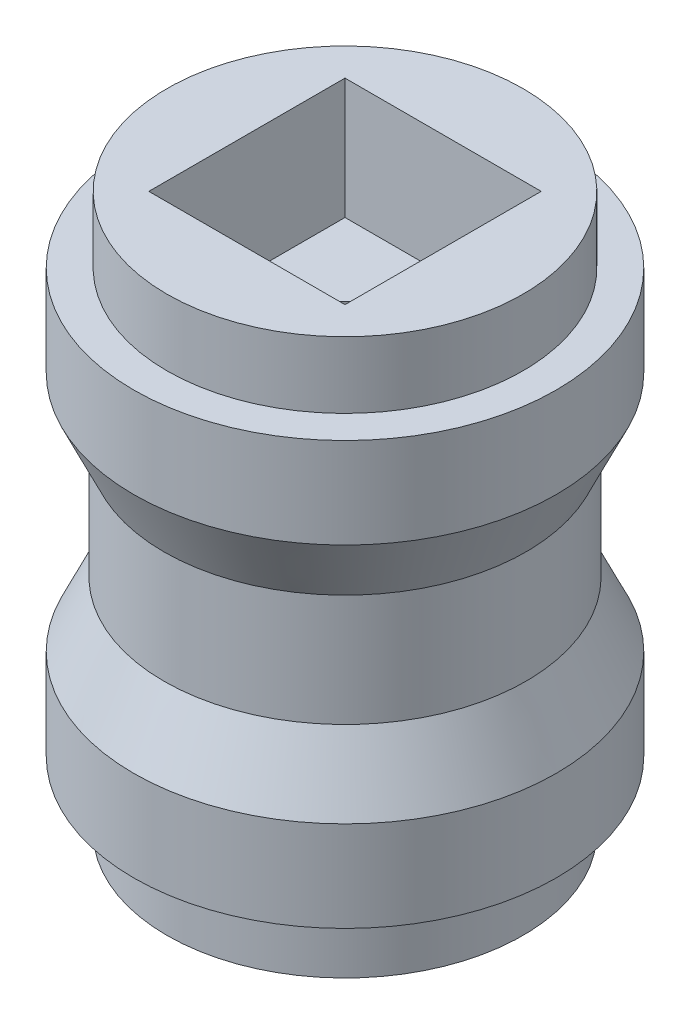
ISO-10303-21;
HEADER;
FILE_DESCRIPTION(('STEP AP214'),'2;1');
FILE_NAME('part.step','',(''),(''),'','','');
FILE_SCHEMA(('AUTOMOTIVE_DESIGN { 1 0 10303 214 1 1 1 1 }'));
ENDSEC;
DATA;
#1=APPLICATION_CONTEXT('core data for automotive mechanical design processes');
#2=APPLICATION_PROTOCOL_DEFINITION('international standard','automotive_design',2000,#1);
#3=PRODUCT_CONTEXT('',#1,'mechanical');
#4=PRODUCT('Part','Part','',(#3));
#5=PRODUCT_RELATED_PRODUCT_CATEGORY('part','',(#4));
#6=PRODUCT_DEFINITION_FORMATION('','',#4);
#7=PRODUCT_DEFINITION_CONTEXT('part definition',#1,'design');
#8=PRODUCT_DEFINITION('design','',#6,#7);
#9=PRODUCT_DEFINITION_SHAPE('','',#8);
#10=(LENGTH_UNIT() NAMED_UNIT(*) SI_UNIT(.MILLI.,.METRE.));
#11=(NAMED_UNIT(*) PLANE_ANGLE_UNIT() SI_UNIT($,.RADIAN.));
#12=(NAMED_UNIT(*) SI_UNIT($,.STERADIAN.) SOLID_ANGLE_UNIT());
#13=UNCERTAINTY_MEASURE_WITH_UNIT(LENGTH_MEASURE(1.E-05),#10,'distance_accuracy_value','');
#14=(GEOMETRIC_REPRESENTATION_CONTEXT(3) GLOBAL_UNCERTAINTY_ASSIGNED_CONTEXT((#13)) GLOBAL_UNIT_ASSIGNED_CONTEXT((#10,
#11,#12)) REPRESENTATION_CONTEXT('',''));
#15=CARTESIAN_POINT('',(0.,0.,0.));
#16=DIRECTION('',(0.,0.,1.));
#17=DIRECTION('',(1.,0.,0.));
#18=AXIS2_PLACEMENT_3D('',#15,#16,#17);
#19=CARTESIAN_POINT('',(0.,3.,0.));
#20=DIRECTION('',(0.,-1.,0.));
#21=DIRECTION('',(0.,0.,-1.));
#22=AXIS2_PLACEMENT_3D('',#19,#20,#21);
#23=CYLINDRICAL_SURFACE('',#22,7.);
#24=CARTESIAN_POINT('',(0.,3.,0.));
#25=DIRECTION('',(0.,1.,0.));
#26=DIRECTION('',(0.,0.,1.));
#27=AXIS2_PLACEMENT_3D('',#24,#25,#26);
#28=CIRCLE('',#27,7.);
#29=CARTESIAN_POINT('',(0.,3.,7.));
#30=VERTEX_POINT('',#29);
#31=EDGE_CURVE('E198',#30,#30,#28,.T.);
#32=ORIENTED_EDGE('',*,*,#31,.F.);
#33=EDGE_LOOP('',(#32));
#34=FACE_BOUND('',#33,.T.);
#35=CARTESIAN_POINT('',(0.,0.,0.));
#36=DIRECTION('',(0.,1.,0.));
#37=DIRECTION('',(0.,0.,1.));
#38=AXIS2_PLACEMENT_3D('',#35,#36,#37);
#39=CIRCLE('',#38,7.);
#40=CARTESIAN_POINT('',(0.,0.,7.));
#41=VERTEX_POINT('',#40);
#42=EDGE_CURVE('E195',#41,#41,#39,.T.);
#43=ORIENTED_EDGE('',*,*,#42,.T.);
#44=EDGE_LOOP('',(#43));
#45=FACE_BOUND('',#44,.T.);
#46=ADVANCED_FACE('F36',(#34,#45),#23,.T.);
#47=CARTESIAN_POINT('',(0.,0.,0.));
#48=DIRECTION('',(0.,1.,0.));
#49=DIRECTION('',(0.,0.,1.));
#50=AXIS2_PLACEMENT_3D('',#47,#48,#49);
#51=PLANE('',#50);
#52=CARTESIAN_POINT('',(0.,0.,0.));
#53=DIRECTION('',(0.,-1.,0.));
#54=DIRECTION('',(0.,0.,-1.));
#55=AXIS2_PLACEMENT_3D('',#52,#53,#54);
#56=CIRCLE('',#55,5.9);
#57=CARTESIAN_POINT('',(0.,0.,-5.9));
#58=VERTEX_POINT('',#57);
#59=EDGE_CURVE('E11',#58,#58,#56,.T.);
#60=ORIENTED_EDGE('',*,*,#59,.F.);
#61=EDGE_LOOP('',(#60));
#62=FACE_BOUND('',#61,.T.);
#63=ORIENTED_EDGE('',*,*,#42,.F.);
#64=EDGE_LOOP('',(#63));
#65=FACE_BOUND('',#64,.T.);
#66=ADVANCED_FACE('F230',(#62,#65),#51,.F.);
#67=CARTESIAN_POINT('',(0.,11.,0.));
#68=DIRECTION('',(0.,-1.,0.));
#69=DIRECTION('',(0.,0.,-1.));
#70=AXIS2_PLACEMENT_3D('',#67,#68,#69);
#71=CYLINDRICAL_SURFACE('',#70,6.);
#72=CARTESIAN_POINT('',(0.,8.85549307949042,0.));
#73=DIRECTION('',(0.,1.,0.));
#74=DIRECTION('',(0.,0.,1.));
#75=AXIS2_PLACEMENT_3D('',#72,#73,#74);
#76=CIRCLE('',#75,6.);
#77=CARTESIAN_POINT('',(0.,8.85549307949042,6.));
#78=VERTEX_POINT('',#77);
#79=EDGE_CURVE('E190',#78,#78,#76,.F.);
#80=ORIENTED_EDGE('',*,*,#79,.T.);
#81=EDGE_LOOP('',(#80));
#82=FACE_BOUND('',#81,.T.);
#83=CARTESIAN_POINT('',(0.,5.1445069205096,0.));
#84=DIRECTION('',(0.,1.,0.));
#85=DIRECTION('',(0.,0.,1.));
#86=AXIS2_PLACEMENT_3D('',#83,#84,#85);
#87=CIRCLE('',#86,6.);
#88=CARTESIAN_POINT('',(0.,5.1445069205096,6.));
#89=VERTEX_POINT('',#88);
#90=EDGE_CURVE('E201',#89,#89,#87,.T.);
#91=ORIENTED_EDGE('',*,*,#90,.T.);
#92=EDGE_LOOP('',(#91));
#93=FACE_BOUND('',#92,.T.);
#94=ADVANCED_FACE('F210',(#82,#93),#71,.T.);
#95=CARTESIAN_POINT('',(0.,14.,0.));
#96=DIRECTION('',(0.,-1.,0.));
#97=DIRECTION('',(0.,0.,-1.));
#98=AXIS2_PLACEMENT_3D('',#95,#96,#97);
#99=CYLINDRICAL_SURFACE('',#98,7.);
#100=CARTESIAN_POINT('',(0.,14.,0.));
#101=DIRECTION('',(0.,1.,0.));
#102=DIRECTION('',(0.,0.,1.));
#103=AXIS2_PLACEMENT_3D('',#100,#101,#102);
#104=CIRCLE('',#103,7.);
#105=CARTESIAN_POINT('',(0.,14.,7.));
#106=VERTEX_POINT('',#105);
#107=EDGE_CURVE('E191',#106,#106,#104,.T.);
#108=ORIENTED_EDGE('',*,*,#107,.F.);
#109=EDGE_LOOP('',(#108));
#110=FACE_BOUND('',#109,.T.);
#111=CARTESIAN_POINT('',(0.,11.,0.));
#112=DIRECTION('',(0.,1.,0.));
#113=DIRECTION('',(0.,0.,1.));
#114=AXIS2_PLACEMENT_3D('',#111,#112,#113);
#115=CIRCLE('',#114,7.);
#116=CARTESIAN_POINT('',(0.,11.,7.));
#117=VERTEX_POINT('',#116);
#118=EDGE_CURVE('E187',#117,#117,#115,.T.);
#119=ORIENTED_EDGE('',*,*,#118,.T.);
#120=EDGE_LOOP('',(#119));
#121=FACE_BOUND('',#120,.T.);
#122=ADVANCED_FACE('F219',(#110,#121),#99,.T.);
#123=CARTESIAN_POINT('',(0.,14.,0.));
#124=DIRECTION('',(0.,1.,0.));
#125=DIRECTION('',(0.,0.,1.));
#126=AXIS2_PLACEMENT_3D('',#123,#124,#125);
#127=PLANE('',#126);
#128=CARTESIAN_POINT('',(0.,14.,0.));
#129=DIRECTION('',(0.,1.,0.));
#130=DIRECTION('',(0.,0.,1.));
#131=AXIS2_PLACEMENT_3D('',#128,#129,#130);
#132=CIRCLE('',#131,5.9);
#133=CARTESIAN_POINT('',(0.,14.,5.9));
#134=VERTEX_POINT('',#133);
#135=EDGE_CURVE('E46',#134,#134,#132,.T.);
#136=ORIENTED_EDGE('',*,*,#135,.F.);
#137=EDGE_LOOP('',(#136));
#138=FACE_BOUND('',#137,.T.);
#139=ORIENTED_EDGE('',*,*,#107,.T.);
#140=EDGE_LOOP('',(#139));
#141=FACE_BOUND('',#140,.T.);
#142=ADVANCED_FACE('F221',(#138,#141),#127,.T.);
#143=CARTESIAN_POINT('',(0.,5.1445069205096,0.));
#144=DIRECTION('',(0.,-1.,0.));
#145=DIRECTION('',(0.,0.,-1.));
#146=AXIS2_PLACEMENT_3D('',#143,#144,#145);
#147=CONICAL_SURFACE('',#146,6.,0.436332312998576);
#148=ORIENTED_EDGE('',*,*,#31,.T.);
#149=EDGE_LOOP('',(#148));
#150=FACE_BOUND('',#149,.T.);
#151=ORIENTED_EDGE('',*,*,#90,.F.);
#152=EDGE_LOOP('',(#151));
#153=FACE_BOUND('',#152,.T.);
#154=ADVANCED_FACE('F216',(#150,#153),#147,.T.);
#155=CARTESIAN_POINT('',(0.,11.,0.));
#156=DIRECTION('',(0.,1.,0.));
#157=DIRECTION('',(0.,0.,1.));
#158=AXIS2_PLACEMENT_3D('',#155,#156,#157);
#159=CONICAL_SURFACE('',#158,6.99999999999999,0.436332312998576);
#160=ORIENTED_EDGE('',*,*,#79,.F.);
#161=EDGE_LOOP('',(#160));
#162=FACE_BOUND('',#161,.T.);
#163=ORIENTED_EDGE('',*,*,#118,.F.);
#164=EDGE_LOOP('',(#163));
#165=FACE_BOUND('',#164,.T.);
#166=ADVANCED_FACE('F38',(#162,#165),#159,.T.);
#167=CARTESIAN_POINT('',(0.,16.2,0.));
#168=DIRECTION('',(0.,-1.,0.));
#169=DIRECTION('',(0.,0.,-1.));
#170=AXIS2_PLACEMENT_3D('',#167,#168,#169);
#171=CYLINDRICAL_SURFACE('',#170,5.9);
#172=CARTESIAN_POINT('',(0.,16.2,0.));
#173=DIRECTION('',(0.,1.,0.));
#174=DIRECTION('',(0.,0.,1.));
#175=AXIS2_PLACEMENT_3D('',#172,#173,#174);
#176=CIRCLE('',#175,5.9);
#177=CARTESIAN_POINT('',(0.,16.2,5.9));
#178=VERTEX_POINT('',#177);
#179=EDGE_CURVE('E183',#178,#178,#176,.T.);
#180=ORIENTED_EDGE('',*,*,#179,.F.);
#181=EDGE_LOOP('',(#180));
#182=FACE_BOUND('',#181,.T.);
#183=ORIENTED_EDGE('',*,*,#135,.T.);
#184=EDGE_LOOP('',(#183));
#185=FACE_BOUND('',#184,.T.);
#186=ADVANCED_FACE('F215',(#182,#185),#171,.T.);
#187=CARTESIAN_POINT('',(0.,16.2,0.));
#188=DIRECTION('',(0.,1.,0.));
#189=DIRECTION('',(0.,0.,1.));
#190=AXIS2_PLACEMENT_3D('',#187,#188,#189);
#191=PLANE('',#190);
#192=DIRECTION('',(0.,0.,-1.));
#193=VECTOR('',#192,1.);
#194=CARTESIAN_POINT('',(3.25,16.2,-3.25));
#195=LINE('',#194,#193);
#196=CARTESIAN_POINT('',(3.25,16.2,3.25));
#197=VERTEX_POINT('',#196);
#198=CARTESIAN_POINT('',(3.25,16.2,-3.25));
#199=VERTEX_POINT('',#198);
#200=EDGE_CURVE('E62',#197,#199,#195,.T.);
#201=ORIENTED_EDGE('',*,*,#200,.F.);
#202=DIRECTION('',(1.,0.,0.));
#203=VECTOR('',#202,1.);
#204=CARTESIAN_POINT('',(-3.25,16.2,3.25));
#205=LINE('',#204,#203);
#206=CARTESIAN_POINT('',(-3.25,16.2,3.25));
#207=VERTEX_POINT('',#206);
#208=EDGE_CURVE('E152',#207,#197,#205,.T.);
#209=ORIENTED_EDGE('',*,*,#208,.F.);
#210=DIRECTION('',(0.,0.,1.));
#211=VECTOR('',#210,1.);
#212=CARTESIAN_POINT('',(-3.25,16.2,-3.25));
#213=LINE('',#212,#211);
#214=CARTESIAN_POINT('',(-3.25,16.2,-3.25));
#215=VERTEX_POINT('',#214);
#216=EDGE_CURVE('E168',#215,#207,#213,.T.);
#217=ORIENTED_EDGE('',*,*,#216,.F.);
#218=DIRECTION('',(-1.,0.,0.));
#219=VECTOR('',#218,1.);
#220=CARTESIAN_POINT('',(-3.25,16.2,-3.25));
#221=LINE('',#220,#219);
#222=EDGE_CURVE('E165',#199,#215,#221,.T.);
#223=ORIENTED_EDGE('',*,*,#222,.F.);
#224=EDGE_LOOP('',(#201,#209,#217,#223));
#225=FACE_BOUND('',#224,.T.);
#226=ORIENTED_EDGE('',*,*,#179,.T.);
#227=EDGE_LOOP('',(#226));
#228=FACE_BOUND('',#227,.T.);
#229=ADVANCED_FACE('F264',(#225,#228),#191,.T.);
#230=CARTESIAN_POINT('',(0.,-2.2,0.));
#231=DIRECTION('',(0.,1.,0.));
#232=DIRECTION('',(0.,0.,1.));
#233=AXIS2_PLACEMENT_3D('',#230,#231,#232);
#234=CYLINDRICAL_SURFACE('',#233,5.9);
#235=CARTESIAN_POINT('',(0.,-2.2,0.));
#236=DIRECTION('',(0.,-1.,0.));
#237=DIRECTION('',(0.,0.,-1.));
#238=AXIS2_PLACEMENT_3D('',#235,#236,#237);
#239=CIRCLE('',#238,5.9);
#240=CARTESIAN_POINT('',(0.,-2.2,-5.9));
#241=VERTEX_POINT('',#240);
#242=EDGE_CURVE('E175',#241,#241,#239,.T.);
#243=ORIENTED_EDGE('',*,*,#242,.F.);
#244=EDGE_LOOP('',(#243));
#245=FACE_BOUND('',#244,.T.);
#246=ORIENTED_EDGE('',*,*,#59,.T.);
#247=EDGE_LOOP('',(#246));
#248=FACE_BOUND('',#247,.T.);
#249=ADVANCED_FACE('F273',(#245,#248),#234,.T.);
#250=CARTESIAN_POINT('',(0.,-2.2,0.));
#251=DIRECTION('',(0.,-1.,0.));
#252=DIRECTION('',(0.,0.,-1.));
#253=AXIS2_PLACEMENT_3D('',#250,#251,#252);
#254=PLANE('',#253);
#255=DIRECTION('',(0.,0.,1.));
#256=VECTOR('',#255,1.);
#257=CARTESIAN_POINT('',(3.25,-2.2,3.25));
#258=LINE('',#257,#256);
#259=CARTESIAN_POINT('',(3.25,-2.2,-3.25));
#260=VERTEX_POINT('',#259);
#261=CARTESIAN_POINT('',(3.25,-2.2,3.25));
#262=VERTEX_POINT('',#261);
#263=EDGE_CURVE('E54',#260,#262,#258,.T.);
#264=ORIENTED_EDGE('',*,*,#263,.F.);
#265=DIRECTION('',(1.,0.,0.));
#266=VECTOR('',#265,1.);
#267=CARTESIAN_POINT('',(-3.25,-2.2,-3.25));
#268=LINE('',#267,#266);
#269=CARTESIAN_POINT('',(-3.25,-2.2,-3.25));
#270=VERTEX_POINT('',#269);
#271=EDGE_CURVE('E125',#270,#260,#268,.T.);
#272=ORIENTED_EDGE('',*,*,#271,.F.);
#273=DIRECTION('',(0.,0.,-1.));
#274=VECTOR('',#273,1.);
#275=CARTESIAN_POINT('',(-3.25,-2.2,3.25));
#276=LINE('',#275,#274);
#277=CARTESIAN_POINT('',(-3.25,-2.2,3.25));
#278=VERTEX_POINT('',#277);
#279=EDGE_CURVE('E128',#278,#270,#276,.T.);
#280=ORIENTED_EDGE('',*,*,#279,.F.);
#281=DIRECTION('',(-1.,0.,0.));
#282=VECTOR('',#281,1.);
#283=CARTESIAN_POINT('',(-3.25,-2.2,3.25));
#284=LINE('',#283,#282);
#285=EDGE_CURVE('E136',#262,#278,#284,.T.);
#286=ORIENTED_EDGE('',*,*,#285,.F.);
#287=EDGE_LOOP('',(#264,#272,#280,#286));
#288=FACE_BOUND('',#287,.T.);
#289=ORIENTED_EDGE('',*,*,#242,.T.);
#290=EDGE_LOOP('',(#289));
#291=FACE_BOUND('',#290,.T.);
#292=ADVANCED_FACE('F282',(#288,#291),#254,.T.);
#293=CARTESIAN_POINT('',(3.25,12.2,-3.25));
#294=DIRECTION('',(1.,0.,0.));
#295=DIRECTION('',(0.,0.,-1.));
#296=AXIS2_PLACEMENT_3D('',#293,#294,#295);
#297=PLANE('',#296);
#298=ORIENTED_EDGE('',*,*,#200,.T.);
#299=DIRECTION('',(0.,1.,0.));
#300=VECTOR('',#299,1.);
#301=CARTESIAN_POINT('',(3.25,12.2,-3.25));
#302=LINE('',#301,#300);
#303=CARTESIAN_POINT('',(3.25,12.2,-3.25));
#304=VERTEX_POINT('',#303);
#305=EDGE_CURVE('E163',#304,#199,#302,.T.);
#306=ORIENTED_EDGE('',*,*,#305,.F.);
#307=DIRECTION('',(0.,0.,-1.));
#308=VECTOR('',#307,1.);
#309=CARTESIAN_POINT('',(3.25,12.2,-3.25));
#310=LINE('',#309,#308);
#311=CARTESIAN_POINT('',(3.25,12.2,3.25));
#312=VERTEX_POINT('',#311);
#313=EDGE_CURVE('E147',#312,#304,#310,.T.);
#314=ORIENTED_EDGE('',*,*,#313,.F.);
#315=DIRECTION('',(0.,1.,0.));
#316=VECTOR('',#315,1.);
#317=CARTESIAN_POINT('',(3.25,12.2,3.25));
#318=LINE('',#317,#316);
#319=EDGE_CURVE('E173',#312,#197,#318,.T.);
#320=ORIENTED_EDGE('',*,*,#319,.T.);
#321=EDGE_LOOP('',(#298,#306,#314,#320));
#322=FACE_BOUND('',#321,.T.);
#323=ADVANCED_FACE('F290',(#322),#297,.F.);
#324=CARTESIAN_POINT('',(-3.25,12.2,3.25));
#325=DIRECTION('',(0.,0.,1.));
#326=DIRECTION('',(1.,0.,0.));
#327=AXIS2_PLACEMENT_3D('',#324,#325,#326);
#328=PLANE('',#327);
#329=ORIENTED_EDGE('',*,*,#208,.T.);
#330=ORIENTED_EDGE('',*,*,#319,.F.);
#331=DIRECTION('',(1.,0.,0.));
#332=VECTOR('',#331,1.);
#333=CARTESIAN_POINT('',(-3.25,12.2,3.25));
#334=LINE('',#333,#332);
#335=CARTESIAN_POINT('',(-3.25,12.2,3.25));
#336=VERTEX_POINT('',#335);
#337=EDGE_CURVE('E159',#336,#312,#334,.T.);
#338=ORIENTED_EDGE('',*,*,#337,.F.);
#339=DIRECTION('',(0.,1.,0.));
#340=VECTOR('',#339,1.);
#341=CARTESIAN_POINT('',(-3.25,12.2,3.25));
#342=LINE('',#341,#340);
#343=EDGE_CURVE('E176',#336,#207,#342,.T.);
#344=ORIENTED_EDGE('',*,*,#343,.T.);
#345=EDGE_LOOP('',(#329,#330,#338,#344));
#346=FACE_BOUND('',#345,.T.);
#347=ADVANCED_FACE('F299',(#346),#328,.F.);
#348=CARTESIAN_POINT('',(-3.25,12.2,-3.25));
#349=DIRECTION('',(-1.,0.,0.));
#350=DIRECTION('',(0.,0.,1.));
#351=AXIS2_PLACEMENT_3D('',#348,#349,#350);
#352=PLANE('',#351);
#353=ORIENTED_EDGE('',*,*,#216,.T.);
#354=ORIENTED_EDGE('',*,*,#343,.F.);
#355=DIRECTION('',(0.,0.,1.));
#356=VECTOR('',#355,1.);
#357=CARTESIAN_POINT('',(-3.25,12.2,-3.25));
#358=LINE('',#357,#356);
#359=CARTESIAN_POINT('',(-3.25,12.2,-3.25));
#360=VERTEX_POINT('',#359);
#361=EDGE_CURVE('E155',#360,#336,#358,.T.);
#362=ORIENTED_EDGE('',*,*,#361,.F.);
#363=DIRECTION('',(0.,1.,0.));
#364=VECTOR('',#363,1.);
#365=CARTESIAN_POINT('',(-3.25,12.2,-3.25));
#366=LINE('',#365,#364);
#367=EDGE_CURVE('E178',#360,#215,#366,.T.);
#368=ORIENTED_EDGE('',*,*,#367,.T.);
#369=EDGE_LOOP('',(#353,#354,#362,#368));
#370=FACE_BOUND('',#369,.T.);
#371=ADVANCED_FACE('F305',(#370),#352,.F.);
#372=CARTESIAN_POINT('',(-3.25,12.2,-3.25));
#373=DIRECTION('',(0.,0.,-1.));
#374=DIRECTION('',(-1.,0.,0.));
#375=AXIS2_PLACEMENT_3D('',#372,#373,#374);
#376=PLANE('',#375);
#377=ORIENTED_EDGE('',*,*,#222,.T.);
#378=ORIENTED_EDGE('',*,*,#367,.F.);
#379=DIRECTION('',(-1.,0.,0.));
#380=VECTOR('',#379,1.);
#381=CARTESIAN_POINT('',(-3.25,12.2,-3.25));
#382=LINE('',#381,#380);
#383=EDGE_CURVE('E151',#304,#360,#382,.T.);
#384=ORIENTED_EDGE('',*,*,#383,.F.);
#385=ORIENTED_EDGE('',*,*,#305,.T.);
#386=EDGE_LOOP('',(#377,#378,#384,#385));
#387=FACE_BOUND('',#386,.T.);
#388=ADVANCED_FACE('F314',(#387),#376,.F.);
#389=CARTESIAN_POINT('',(0.,12.2,0.));
#390=DIRECTION('',(0.,1.,0.));
#391=DIRECTION('',(0.,0.,1.));
#392=AXIS2_PLACEMENT_3D('',#389,#390,#391);
#393=PLANE('',#392);
#394=CARTESIAN_POINT('',(0.,12.2,0.));
#395=DIRECTION('',(0.,1.,0.));
#396=DIRECTION('',(0.,0.,1.));
#397=AXIS2_PLACEMENT_3D('',#394,#395,#396);
#398=CIRCLE('',#397,1.2);
#399=CARTESIAN_POINT('',(0.,12.2,1.2));
#400=VERTEX_POINT('',#399);
#401=EDGE_CURVE('E40',#400,#400,#398,.T.);
#402=ORIENTED_EDGE('',*,*,#401,.F.);
#403=EDGE_LOOP('',(#402));
#404=FACE_BOUND('',#403,.T.);
#405=ORIENTED_EDGE('',*,*,#313,.T.);
#406=ORIENTED_EDGE('',*,*,#383,.T.);
#407=ORIENTED_EDGE('',*,*,#361,.T.);
#408=ORIENTED_EDGE('',*,*,#337,.T.);
#409=EDGE_LOOP('',(#405,#406,#407,#408));
#410=FACE_BOUND('',#409,.T.);
#411=ADVANCED_FACE('F321',(#404,#410),#393,.T.);
#412=CARTESIAN_POINT('',(3.25,1.8,3.25));
#413=DIRECTION('',(1.,0.,0.));
#414=DIRECTION('',(0.,0.,-1.));
#415=AXIS2_PLACEMENT_3D('',#412,#413,#414);
#416=PLANE('',#415);
#417=ORIENTED_EDGE('',*,*,#263,.T.);
#418=DIRECTION('',(0.,-1.,0.));
#419=VECTOR('',#418,1.);
#420=CARTESIAN_POINT('',(3.25,1.8,3.25));
#421=LINE('',#420,#419);
#422=CARTESIAN_POINT('',(3.25,1.8,3.25));
#423=VERTEX_POINT('',#422);
#424=EDGE_CURVE('E102',#423,#262,#421,.T.);
#425=ORIENTED_EDGE('',*,*,#424,.F.);
#426=DIRECTION('',(0.,0.,1.));
#427=VECTOR('',#426,1.);
#428=CARTESIAN_POINT('',(3.25,1.8,3.25));
#429=LINE('',#428,#427);
#430=CARTESIAN_POINT('',(3.25,1.8,-3.25));
#431=VERTEX_POINT('',#430);
#432=EDGE_CURVE('E106',#431,#423,#429,.T.);
#433=ORIENTED_EDGE('',*,*,#432,.F.);
#434=DIRECTION('',(0.,-1.,0.));
#435=VECTOR('',#434,1.);
#436=CARTESIAN_POINT('',(3.25,1.8,-3.25));
#437=LINE('',#436,#435);
#438=EDGE_CURVE('E141',#431,#260,#437,.T.);
#439=ORIENTED_EDGE('',*,*,#438,.T.);
#440=EDGE_LOOP('',(#417,#425,#433,#439));
#441=FACE_BOUND('',#440,.T.);
#442=ADVANCED_FACE('F104',(#441),#416,.F.);
#443=CARTESIAN_POINT('',(-3.25,1.8,-3.25));
#444=DIRECTION('',(0.,0.,-1.));
#445=DIRECTION('',(-1.,0.,0.));
#446=AXIS2_PLACEMENT_3D('',#443,#444,#445);
#447=PLANE('',#446);
#448=ORIENTED_EDGE('',*,*,#271,.T.);
#449=ORIENTED_EDGE('',*,*,#438,.F.);
#450=DIRECTION('',(1.,0.,0.));
#451=VECTOR('',#450,1.);
#452=CARTESIAN_POINT('',(-3.25,1.8,-3.25));
#453=LINE('',#452,#451);
#454=CARTESIAN_POINT('',(-3.25,1.8,-3.25));
#455=VERTEX_POINT('',#454);
#456=EDGE_CURVE('E112',#455,#431,#453,.T.);
#457=ORIENTED_EDGE('',*,*,#456,.F.);
#458=DIRECTION('',(0.,-1.,0.));
#459=VECTOR('',#458,1.);
#460=CARTESIAN_POINT('',(-3.25,1.8,-3.25));
#461=LINE('',#460,#459);
#462=EDGE_CURVE('E143',#455,#270,#461,.T.);
#463=ORIENTED_EDGE('',*,*,#462,.T.);
#464=EDGE_LOOP('',(#448,#449,#457,#463));
#465=FACE_BOUND('',#464,.T.);
#466=ADVANCED_FACE('F335',(#465),#447,.F.);
#467=CARTESIAN_POINT('',(-3.25,1.8,3.25));
#468=DIRECTION('',(-1.,0.,0.));
#469=DIRECTION('',(0.,0.,1.));
#470=AXIS2_PLACEMENT_3D('',#467,#468,#469);
#471=PLANE('',#470);
#472=ORIENTED_EDGE('',*,*,#279,.T.);
#473=ORIENTED_EDGE('',*,*,#462,.F.);
#474=DIRECTION('',(0.,0.,-1.));
#475=VECTOR('',#474,1.);
#476=CARTESIAN_POINT('',(-3.25,1.8,3.25));
#477=LINE('',#476,#475);
#478=CARTESIAN_POINT('',(-3.25,1.8,3.25));
#479=VERTEX_POINT('',#478);
#480=EDGE_CURVE('E121',#479,#455,#477,.T.);
#481=ORIENTED_EDGE('',*,*,#480,.F.);
#482=DIRECTION('',(0.,-1.,0.));
#483=VECTOR('',#482,1.);
#484=CARTESIAN_POINT('',(-3.25,1.8,3.25));
#485=LINE('',#484,#483);
#486=EDGE_CURVE('E111',#479,#278,#485,.T.);
#487=ORIENTED_EDGE('',*,*,#486,.T.);
#488=EDGE_LOOP('',(#472,#473,#481,#487));
#489=FACE_BOUND('',#488,.T.);
#490=ADVANCED_FACE('F342',(#489),#471,.F.);
#491=CARTESIAN_POINT('',(-3.25,1.8,3.25));
#492=DIRECTION('',(0.,0.,1.));
#493=DIRECTION('',(1.,0.,0.));
#494=AXIS2_PLACEMENT_3D('',#491,#492,#493);
#495=PLANE('',#494);
#496=ORIENTED_EDGE('',*,*,#285,.T.);
#497=ORIENTED_EDGE('',*,*,#486,.F.);
#498=DIRECTION('',(-1.,0.,0.));
#499=VECTOR('',#498,1.);
#500=CARTESIAN_POINT('',(-3.25,1.8,3.25));
#501=LINE('',#500,#499);
#502=EDGE_CURVE('E115',#423,#479,#501,.T.);
#503=ORIENTED_EDGE('',*,*,#502,.F.);
#504=ORIENTED_EDGE('',*,*,#424,.T.);
#505=EDGE_LOOP('',(#496,#497,#503,#504));
#506=FACE_BOUND('',#505,.T.);
#507=ADVANCED_FACE('F116',(#506),#495,.F.);
#508=CARTESIAN_POINT('',(0.,1.8,0.));
#509=DIRECTION('',(0.,-1.,0.));
#510=DIRECTION('',(0.,0.,-1.));
#511=AXIS2_PLACEMENT_3D('',#508,#509,#510);
#512=PLANE('',#511);
#513=CARTESIAN_POINT('',(0.,1.8,0.));
#514=DIRECTION('',(0.,-1.,0.));
#515=DIRECTION('',(0.,0.,-1.));
#516=AXIS2_PLACEMENT_3D('',#513,#514,#515);
#517=CIRCLE('',#516,1.2);
#518=CARTESIAN_POINT('',(0.,1.8,-1.2));
#519=VERTEX_POINT('',#518);
#520=EDGE_CURVE('E131',#519,#519,#517,.T.);
#521=ORIENTED_EDGE('',*,*,#520,.F.);
#522=EDGE_LOOP('',(#521));
#523=FACE_BOUND('',#522,.T.);
#524=ORIENTED_EDGE('',*,*,#432,.T.);
#525=ORIENTED_EDGE('',*,*,#502,.T.);
#526=ORIENTED_EDGE('',*,*,#480,.T.);
#527=ORIENTED_EDGE('',*,*,#456,.T.);
#528=EDGE_LOOP('',(#524,#525,#526,#527));
#529=FACE_BOUND('',#528,.T.);
#530=ADVANCED_FACE('F123',(#523,#529),#512,.T.);
#531=CARTESIAN_POINT('',(0.,16.2,0.));
#532=DIRECTION('',(0.,-1.,0.));
#533=DIRECTION('',(0.,0.,-1.));
#534=AXIS2_PLACEMENT_3D('',#531,#532,#533);
#535=CYLINDRICAL_SURFACE('',#534,1.2);
#536=ORIENTED_EDGE('',*,*,#401,.T.);
#537=EDGE_LOOP('',(#536));
#538=FACE_BOUND('',#537,.T.);
#539=ORIENTED_EDGE('',*,*,#520,.T.);
#540=EDGE_LOOP('',(#539));
#541=FACE_BOUND('',#540,.T.);
#542=ADVANCED_FACE('F363',(#538,#541),#535,.F.);
#543=CLOSED_SHELL('',(#46,#66,#94,#122,#142,#154,#166,#186,#229,#249,#292,#323,#347,#371,#388,
#411,#442,#466,#490,#507,#530,#542));
#544=MANIFOLD_SOLID_BREP('B2',#543);
#545=ADVANCED_BREP_SHAPE_REPRESENTATION('',(#18,#544),#14);
#546=SHAPE_DEFINITION_REPRESENTATION(#9,#545);
ENDSEC;
END-ISO-10303-21;
